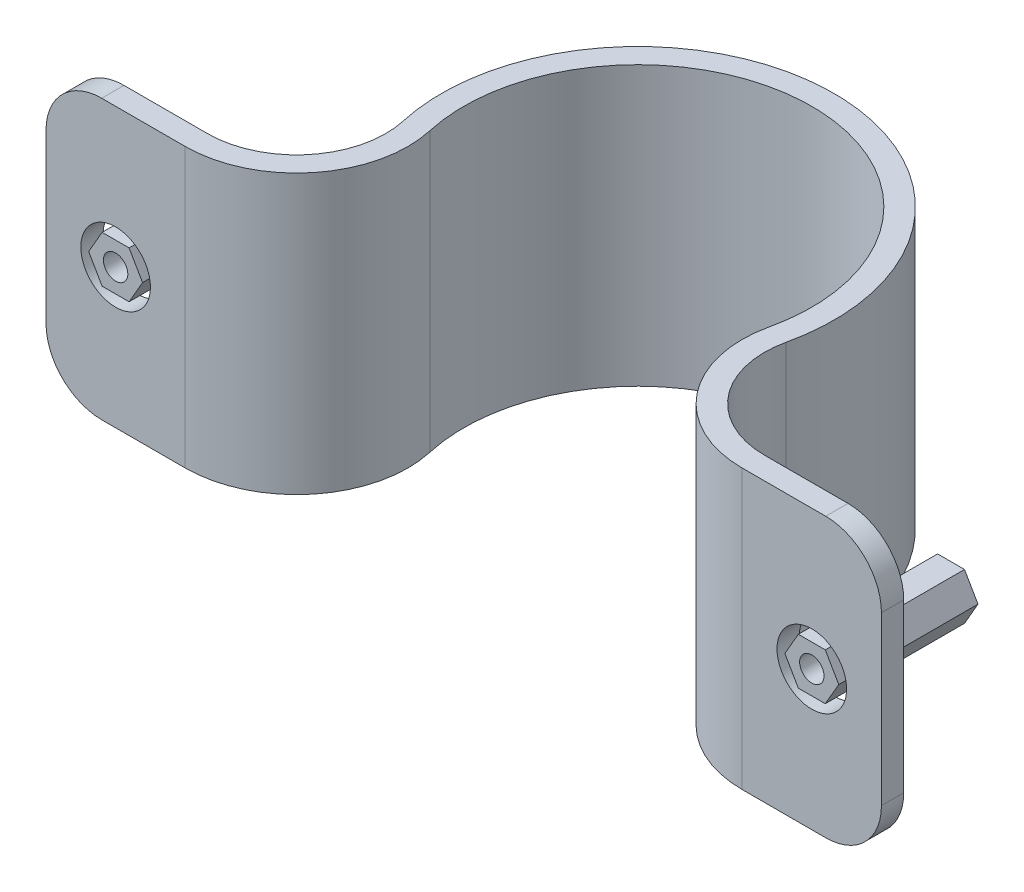
ISO-10303-21;
HEADER;
FILE_DESCRIPTION(('STEP AP214'),'2;1');
FILE_NAME('part.step','',(''),(''),'','','');
FILE_SCHEMA(('AUTOMOTIVE_DESIGN { 1 0 10303 214 1 1 1 1 }'));
ENDSEC;
DATA;
#1=APPLICATION_CONTEXT('core data for automotive mechanical design processes');
#2=APPLICATION_PROTOCOL_DEFINITION('international standard','automotive_design',2000,#1);
#3=PRODUCT_CONTEXT('',#1,'mechanical');
#4=PRODUCT('Part','Part','',(#3));
#5=PRODUCT_RELATED_PRODUCT_CATEGORY('part','',(#4));
#6=PRODUCT_DEFINITION_FORMATION('','',#4);
#7=PRODUCT_DEFINITION_CONTEXT('part definition',#1,'design');
#8=PRODUCT_DEFINITION('design','',#6,#7);
#9=PRODUCT_DEFINITION_SHAPE('','',#8);
#10=(LENGTH_UNIT() NAMED_UNIT(*) SI_UNIT(.MILLI.,.METRE.));
#11=(NAMED_UNIT(*) PLANE_ANGLE_UNIT() SI_UNIT($,.RADIAN.));
#12=(NAMED_UNIT(*) SI_UNIT($,.STERADIAN.) SOLID_ANGLE_UNIT());
#13=UNCERTAINTY_MEASURE_WITH_UNIT(LENGTH_MEASURE(1.E-05),#10,'distance_accuracy_value','');
#14=(GEOMETRIC_REPRESENTATION_CONTEXT(3) GLOBAL_UNCERTAINTY_ASSIGNED_CONTEXT((#13)) GLOBAL_UNIT_ASSIGNED_CONTEXT((#10,
#11,#12)) REPRESENTATION_CONTEXT('',''));
#15=CARTESIAN_POINT('',(0.,0.,0.));
#16=DIRECTION('',(0.,0.,1.));
#17=DIRECTION('',(1.,0.,0.));
#18=AXIS2_PLACEMENT_3D('',#15,#16,#17);
#19=CARTESIAN_POINT('',(32.9788858266036,10.5715073116213,-12.7));
#20=DIRECTION('',(0.,-1.,0.));
#21=DIRECTION('',(0.,0.,-1.));
#22=AXIS2_PLACEMENT_3D('',#19,#20,#21);
#23=PLANE('',#22);
#24=DIRECTION('',(1.,0.,0.));
#25=VECTOR('',#24,1.);
#26=CARTESIAN_POINT('',(32.9788858266036,10.5715073116213,0.));
#27=LINE('',#26,#25);
#28=CARTESIAN_POINT('',(30.5211141733964,10.5715073116213,0.));
#29=VERTEX_POINT('',#28);
#30=CARTESIAN_POINT('',(32.9788858266036,10.5715073116213,0.));
#31=VERTEX_POINT('',#30);
#32=EDGE_CURVE('E131',#29,#31,#27,.T.);
#33=ORIENTED_EDGE('',*,*,#32,.F.);
#34=DIRECTION('',(0.,0.,1.));
#35=VECTOR('',#34,1.);
#36=CARTESIAN_POINT('',(30.5211141733964,10.5715073116213,-12.7));
#37=LINE('',#36,#35);
#38=CARTESIAN_POINT('',(30.5211141733964,10.5715073116213,-12.7));
#39=VERTEX_POINT('',#38);
#40=EDGE_CURVE('E12',#39,#29,#37,.T.);
#41=ORIENTED_EDGE('',*,*,#40,.F.);
#42=DIRECTION('',(1.,0.,0.));
#43=VECTOR('',#42,1.);
#44=CARTESIAN_POINT('',(32.9788858266036,10.5715073116213,-12.7));
#45=LINE('',#44,#43);
#46=CARTESIAN_POINT('',(32.9788858266036,10.5715073116213,-12.7));
#47=VERTEX_POINT('',#46);
#48=EDGE_CURVE('E146',#39,#47,#45,.T.);
#49=ORIENTED_EDGE('',*,*,#48,.T.);
#50=DIRECTION('',(0.,0.,1.));
#51=VECTOR('',#50,1.);
#52=CARTESIAN_POINT('',(32.9788858266036,10.5715073116213,-12.7));
#53=LINE('',#52,#51);
#54=EDGE_CURVE('E49',#47,#31,#53,.T.);
#55=ORIENTED_EDGE('',*,*,#54,.T.);
#56=EDGE_LOOP('',(#33,#41,#49,#55));
#57=FACE_BOUND('',#56,.T.);
#58=ADVANCED_FACE('F46',(#57),#23,.T.);
#59=CARTESIAN_POINT('',(30.5211141733964,10.5715073116213,-12.7));
#60=DIRECTION('',(-0.866025403784439,-0.5,0.));
#61=DIRECTION('',(0.5,-0.866025403784439,0.));
#62=AXIS2_PLACEMENT_3D('',#59,#60,#61);
#63=PLANE('',#62);
#64=DIRECTION('',(0.5,-0.866025403784439,0.));
#65=VECTOR('',#64,1.);
#66=CARTESIAN_POINT('',(30.5211141733964,10.5715073116213,0.));
#67=LINE('',#66,#65);
#68=CARTESIAN_POINT('',(29.2922283467929,12.7,0.));
#69=VERTEX_POINT('',#68);
#70=EDGE_CURVE('E144',#69,#29,#67,.T.);
#71=ORIENTED_EDGE('',*,*,#70,.F.);
#72=DIRECTION('',(0.,0.,1.));
#73=VECTOR('',#72,1.);
#74=CARTESIAN_POINT('',(29.2922283467929,12.7,-12.7));
#75=LINE('',#74,#73);
#76=CARTESIAN_POINT('',(29.2922283467929,12.7,-12.7));
#77=VERTEX_POINT('',#76);
#78=EDGE_CURVE('E55',#77,#69,#75,.T.);
#79=ORIENTED_EDGE('',*,*,#78,.F.);
#80=DIRECTION('',(0.5,-0.866025403784439,0.));
#81=VECTOR('',#80,1.);
#82=CARTESIAN_POINT('',(30.5211141733964,10.5715073116213,-12.7));
#83=LINE('',#82,#81);
#84=EDGE_CURVE('E121',#77,#39,#83,.T.);
#85=ORIENTED_EDGE('',*,*,#84,.T.);
#86=ORIENTED_EDGE('',*,*,#40,.T.);
#87=EDGE_LOOP('',(#71,#79,#85,#86));
#88=FACE_BOUND('',#87,.T.);
#89=ADVANCED_FACE('F154',(#88),#63,.T.);
#90=CARTESIAN_POINT('',(29.2922283467929,12.7,-12.7));
#91=DIRECTION('',(-0.866025403784437,0.500000000000002,0.));
#92=DIRECTION('',(-0.500000000000002,-0.866025403784438,0.));
#93=AXIS2_PLACEMENT_3D('',#90,#91,#92);
#94=PLANE('',#93);
#95=DIRECTION('',(-0.500000000000002,-0.866025403784437,0.));
#96=VECTOR('',#95,1.);
#97=CARTESIAN_POINT('',(29.2922283467929,12.7,0.));
#98=LINE('',#97,#96);
#99=CARTESIAN_POINT('',(30.5211141733964,14.8284926883786,0.));
#100=VERTEX_POINT('',#99);
#101=EDGE_CURVE('E108',#100,#69,#98,.T.);
#102=ORIENTED_EDGE('',*,*,#101,.F.);
#103=DIRECTION('',(0.,0.,1.));
#104=VECTOR('',#103,1.);
#105=CARTESIAN_POINT('',(30.5211141733964,14.8284926883786,-12.7));
#106=LINE('',#105,#104);
#107=CARTESIAN_POINT('',(30.5211141733964,14.8284926883786,-12.7));
#108=VERTEX_POINT('',#107);
#109=EDGE_CURVE('E103',#108,#100,#106,.T.);
#110=ORIENTED_EDGE('',*,*,#109,.F.);
#111=DIRECTION('',(-0.500000000000002,-0.866025403784437,0.));
#112=VECTOR('',#111,1.);
#113=CARTESIAN_POINT('',(29.2922283467929,12.7,-12.7));
#114=LINE('',#113,#112);
#115=EDGE_CURVE('E106',#108,#77,#114,.T.);
#116=ORIENTED_EDGE('',*,*,#115,.T.);
#117=ORIENTED_EDGE('',*,*,#78,.T.);
#118=EDGE_LOOP('',(#102,#110,#116,#117));
#119=FACE_BOUND('',#118,.T.);
#120=ADVANCED_FACE('F105',(#119),#94,.T.);
#121=CARTESIAN_POINT('',(30.5211141733964,14.8284926883786,-12.7));
#122=DIRECTION('',(0.,1.,0.));
#123=DIRECTION('',(-1.,0.,0.));
#124=AXIS2_PLACEMENT_3D('',#121,#122,#123);
#125=PLANE('',#124);
#126=DIRECTION('',(-1.,0.,0.));
#127=VECTOR('',#126,1.);
#128=CARTESIAN_POINT('',(30.5211141733964,14.8284926883786,0.));
#129=LINE('',#128,#127);
#130=CARTESIAN_POINT('',(32.9788858266036,14.8284926883786,0.));
#131=VERTEX_POINT('',#130);
#132=EDGE_CURVE('E141',#131,#100,#129,.T.);
#133=ORIENTED_EDGE('',*,*,#132,.F.);
#134=DIRECTION('',(0.,0.,1.));
#135=VECTOR('',#134,1.);
#136=CARTESIAN_POINT('',(32.9788858266036,14.8284926883786,-12.7));
#137=LINE('',#136,#135);
#138=CARTESIAN_POINT('',(32.9788858266036,14.8284926883786,-12.7));
#139=VERTEX_POINT('',#138);
#140=EDGE_CURVE('E113',#139,#131,#137,.T.);
#141=ORIENTED_EDGE('',*,*,#140,.F.);
#142=DIRECTION('',(-1.,0.,0.));
#143=VECTOR('',#142,1.);
#144=CARTESIAN_POINT('',(30.5211141733964,14.8284926883786,-12.7));
#145=LINE('',#144,#143);
#146=EDGE_CURVE('E119',#139,#108,#145,.T.);
#147=ORIENTED_EDGE('',*,*,#146,.T.);
#148=ORIENTED_EDGE('',*,*,#109,.T.);
#149=EDGE_LOOP('',(#133,#141,#147,#148));
#150=FACE_BOUND('',#149,.T.);
#151=ADVANCED_FACE('F123',(#150),#125,.T.);
#152=CARTESIAN_POINT('',(32.9788858266036,14.8284926883786,-12.7));
#153=DIRECTION('',(0.866025403784439,0.5,0.));
#154=DIRECTION('',(-0.5,0.866025403784439,0.));
#155=AXIS2_PLACEMENT_3D('',#152,#153,#154);
#156=PLANE('',#155);
#157=DIRECTION('',(-0.5,0.866025403784439,0.));
#158=VECTOR('',#157,1.);
#159=CARTESIAN_POINT('',(32.9788858266036,14.8284926883786,0.));
#160=LINE('',#159,#158);
#161=CARTESIAN_POINT('',(34.2077716532071,12.7,0.));
#162=VERTEX_POINT('',#161);
#163=EDGE_CURVE('E138',#162,#131,#160,.T.);
#164=ORIENTED_EDGE('',*,*,#163,.F.);
#165=DIRECTION('',(0.,0.,1.));
#166=VECTOR('',#165,1.);
#167=CARTESIAN_POINT('',(34.2077716532071,12.7,-12.7));
#168=LINE('',#167,#166);
#169=CARTESIAN_POINT('',(34.2077716532071,12.7,-12.7));
#170=VERTEX_POINT('',#169);
#171=EDGE_CURVE('E149',#170,#162,#168,.T.);
#172=ORIENTED_EDGE('',*,*,#171,.F.);
#173=DIRECTION('',(-0.5,0.866025403784439,0.));
#174=VECTOR('',#173,1.);
#175=CARTESIAN_POINT('',(32.9788858266036,14.8284926883786,-12.7));
#176=LINE('',#175,#174);
#177=EDGE_CURVE('E124',#170,#139,#176,.T.);
#178=ORIENTED_EDGE('',*,*,#177,.T.);
#179=ORIENTED_EDGE('',*,*,#140,.T.);
#180=EDGE_LOOP('',(#164,#172,#178,#179));
#181=FACE_BOUND('',#180,.T.);
#182=ADVANCED_FACE('F167',(#181),#156,.T.);
#183=CARTESIAN_POINT('',(34.2077716532071,12.7,-12.7));
#184=DIRECTION('',(0.86602540378444,-0.499999999999998,0.));
#185=DIRECTION('',(0.499999999999998,0.86602540378444,0.));
#186=AXIS2_PLACEMENT_3D('',#183,#184,#185);
#187=PLANE('',#186);
#188=DIRECTION('',(0.499999999999998,0.86602540378444,0.));
#189=VECTOR('',#188,1.);
#190=CARTESIAN_POINT('',(34.2077716532071,12.7,0.));
#191=LINE('',#190,#189);
#192=EDGE_CURVE('E134',#31,#162,#191,.T.);
#193=ORIENTED_EDGE('',*,*,#192,.F.);
#194=ORIENTED_EDGE('',*,*,#54,.F.);
#195=DIRECTION('',(0.499999999999998,0.86602540378444,0.));
#196=VECTOR('',#195,1.);
#197=CARTESIAN_POINT('',(34.2077716532071,12.7,-12.7));
#198=LINE('',#197,#196);
#199=EDGE_CURVE('E126',#47,#170,#198,.T.);
#200=ORIENTED_EDGE('',*,*,#199,.T.);
#201=ORIENTED_EDGE('',*,*,#171,.T.);
#202=EDGE_LOOP('',(#193,#194,#200,#201));
#203=FACE_BOUND('',#202,.T.);
#204=ADVANCED_FACE('F151',(#203),#187,.T.);
#205=CARTESIAN_POINT('',(0.,0.,-12.7));
#206=DIRECTION('',(0.,0.,-1.));
#207=DIRECTION('',(-1.,0.,0.));
#208=AXIS2_PLACEMENT_3D('',#205,#206,#207);
#209=PLANE('',#208);
#210=CARTESIAN_POINT('',(31.75,12.7,-12.7));
#211=DIRECTION('',(0.,0.,1.));
#212=DIRECTION('',(-1.,0.,0.));
#213=AXIS2_PLACEMENT_3D('',#210,#211,#212);
#214=CIRCLE('',#213,1.11249268837864);
#215=CARTESIAN_POINT('',(30.6375073116214,12.7,-12.7));
#216=VERTEX_POINT('',#215);
#217=EDGE_CURVE('E135',#216,#216,#214,.T.);
#218=ORIENTED_EDGE('',*,*,#217,.T.);
#219=EDGE_LOOP('',(#218));
#220=FACE_BOUND('',#219,.T.);
#221=ORIENTED_EDGE('',*,*,#48,.F.);
#222=ORIENTED_EDGE('',*,*,#84,.F.);
#223=ORIENTED_EDGE('',*,*,#115,.F.);
#224=ORIENTED_EDGE('',*,*,#146,.F.);
#225=ORIENTED_EDGE('',*,*,#177,.F.);
#226=ORIENTED_EDGE('',*,*,#199,.F.);
#227=EDGE_LOOP('',(#221,#222,#223,#224,#225,#226));
#228=FACE_BOUND('',#227,.T.);
#229=ADVANCED_FACE('F117',(#220,#228),#209,.T.);
#230=CARTESIAN_POINT('',(0.,0.,0.));
#231=DIRECTION('',(0.,0.,-1.));
#232=DIRECTION('',(-1.,0.,0.));
#233=AXIS2_PLACEMENT_3D('',#230,#231,#232);
#234=PLANE('',#233);
#235=CARTESIAN_POINT('',(31.75,12.7,0.));
#236=DIRECTION('',(0.,0.,1.));
#237=DIRECTION('',(-1.,0.,0.));
#238=AXIS2_PLACEMENT_3D('',#235,#236,#237);
#239=CIRCLE('',#238,1.11249268837864);
#240=CARTESIAN_POINT('',(30.6375073116214,12.7,0.));
#241=VERTEX_POINT('',#240);
#242=EDGE_CURVE('E190',#241,#241,#239,.T.);
#243=ORIENTED_EDGE('',*,*,#242,.F.);
#244=EDGE_LOOP('',(#243));
#245=FACE_BOUND('',#244,.T.);
#246=ORIENTED_EDGE('',*,*,#32,.T.);
#247=ORIENTED_EDGE('',*,*,#192,.T.);
#248=ORIENTED_EDGE('',*,*,#163,.T.);
#249=ORIENTED_EDGE('',*,*,#132,.T.);
#250=ORIENTED_EDGE('',*,*,#101,.T.);
#251=ORIENTED_EDGE('',*,*,#70,.T.);
#252=EDGE_LOOP('',(#246,#247,#248,#249,#250,#251));
#253=FACE_BOUND('',#252,.T.);
#254=ADVANCED_FACE('F153',(#245,#253),#234,.F.);
#255=CARTESIAN_POINT('',(31.75,12.7,-12.7));
#256=DIRECTION('',(0.,0.,1.));
#257=DIRECTION('',(1.,0.,0.));
#258=AXIS2_PLACEMENT_3D('',#255,#256,#257);
#259=CYLINDRICAL_SURFACE('',#258,1.11249268837864);
#260=ORIENTED_EDGE('',*,*,#217,.F.);
#261=EDGE_LOOP('',(#260));
#262=FACE_BOUND('',#261,.T.);
#263=ORIENTED_EDGE('',*,*,#242,.T.);
#264=EDGE_LOOP('',(#263));
#265=FACE_BOUND('',#264,.T.);
#266=ADVANCED_FACE('F178',(#262,#265),#259,.F.);
#267=CLOSED_SHELL('',(#58,#89,#120,#151,#182,#204,#229,#254,#266));
#268=MANIFOLD_SOLID_BREP('B2',#267);
#269=CARTESIAN_POINT('',(-30.5211141733964,10.5715073116214,-12.7));
#270=DIRECTION('',(0.866025403784439,-0.5,0.));
#271=DIRECTION('',(0.5,0.866025403784439,0.));
#272=AXIS2_PLACEMENT_3D('',#269,#270,#271);
#273=PLANE('',#272);
#274=DIRECTION('',(0.5,0.866025403784439,0.));
#275=VECTOR('',#274,1.);
#276=CARTESIAN_POINT('',(-30.5211141733964,10.5715073116214,0.));
#277=LINE('',#276,#275);
#278=CARTESIAN_POINT('',(-30.5211141733964,10.5715073116214,0.));
#279=VERTEX_POINT('',#278);
#280=CARTESIAN_POINT('',(-29.2922283467929,12.7,0.));
#281=VERTEX_POINT('',#280);
#282=EDGE_CURVE('E337',#279,#281,#277,.T.);
#283=ORIENTED_EDGE('',*,*,#282,.F.);
#284=DIRECTION('',(0.,0.,1.));
#285=VECTOR('',#284,1.);
#286=CARTESIAN_POINT('',(-30.5211141733964,10.5715073116214,-12.7));
#287=LINE('',#286,#285);
#288=CARTESIAN_POINT('',(-30.5211141733964,10.5715073116214,-12.7));
#289=VERTEX_POINT('',#288);
#290=EDGE_CURVE('E44',#289,#279,#287,.T.);
#291=ORIENTED_EDGE('',*,*,#290,.F.);
#292=DIRECTION('',(0.5,0.866025403784439,0.));
#293=VECTOR('',#292,1.);
#294=CARTESIAN_POINT('',(-30.5211141733964,10.5715073116214,-12.7));
#295=LINE('',#294,#293);
#296=CARTESIAN_POINT('',(-29.2922283467929,12.7,-12.7));
#297=VERTEX_POINT('',#296);
#298=EDGE_CURVE('E352',#289,#297,#295,.T.);
#299=ORIENTED_EDGE('',*,*,#298,.T.);
#300=DIRECTION('',(0.,0.,1.));
#301=VECTOR('',#300,1.);
#302=CARTESIAN_POINT('',(-29.2922283467929,12.7,-12.7));
#303=LINE('',#302,#301);
#304=EDGE_CURVE('E255',#297,#281,#303,.T.);
#305=ORIENTED_EDGE('',*,*,#304,.T.);
#306=EDGE_LOOP('',(#283,#291,#299,#305));
#307=FACE_BOUND('',#306,.T.);
#308=ADVANCED_FACE('F252',(#307),#273,.T.);
#309=CARTESIAN_POINT('',(-32.9788858266036,10.5715073116214,-12.7));
#310=DIRECTION('',(0.,-1.,0.));
#311=DIRECTION('',(0.,0.,-1.));
#312=AXIS2_PLACEMENT_3D('',#309,#310,#311);
#313=PLANE('',#312);
#314=DIRECTION('',(1.,0.,0.));
#315=VECTOR('',#314,1.);
#316=CARTESIAN_POINT('',(-32.9788858266036,10.5715073116214,0.));
#317=LINE('',#316,#315);
#318=CARTESIAN_POINT('',(-32.9788858266036,10.5715073116214,0.));
#319=VERTEX_POINT('',#318);
#320=EDGE_CURVE('E350',#319,#279,#317,.T.);
#321=ORIENTED_EDGE('',*,*,#320,.F.);
#322=DIRECTION('',(0.,0.,1.));
#323=VECTOR('',#322,1.);
#324=CARTESIAN_POINT('',(-32.9788858266036,10.5715073116214,-12.7));
#325=LINE('',#324,#323);
#326=CARTESIAN_POINT('',(-32.9788858266036,10.5715073116214,-12.7));
#327=VERTEX_POINT('',#326);
#328=EDGE_CURVE('E261',#327,#319,#325,.T.);
#329=ORIENTED_EDGE('',*,*,#328,.F.);
#330=DIRECTION('',(1.,0.,0.));
#331=VECTOR('',#330,1.);
#332=CARTESIAN_POINT('',(-32.9788858266036,10.5715073116214,-12.7));
#333=LINE('',#332,#331);
#334=EDGE_CURVE('E327',#327,#289,#333,.T.);
#335=ORIENTED_EDGE('',*,*,#334,.T.);
#336=ORIENTED_EDGE('',*,*,#290,.T.);
#337=EDGE_LOOP('',(#321,#329,#335,#336));
#338=FACE_BOUND('',#337,.T.);
#339=ADVANCED_FACE('F360',(#338),#313,.T.);
#340=CARTESIAN_POINT('',(-34.2077716532071,12.7,-12.7));
#341=DIRECTION('',(-0.86602540378444,-0.499999999999998,0.));
#342=DIRECTION('',(0.499999999999998,-0.86602540378444,0.));
#343=AXIS2_PLACEMENT_3D('',#340,#341,#342);
#344=PLANE('',#343);
#345=DIRECTION('',(0.499999999999998,-0.86602540378444,0.));
#346=VECTOR('',#345,1.);
#347=CARTESIAN_POINT('',(-34.2077716532071,12.7,0.));
#348=LINE('',#347,#346);
#349=CARTESIAN_POINT('',(-34.2077716532071,12.7,0.));
#350=VERTEX_POINT('',#349);
#351=EDGE_CURVE('E314',#350,#319,#348,.T.);
#352=ORIENTED_EDGE('',*,*,#351,.F.);
#353=DIRECTION('',(0.,0.,1.));
#354=VECTOR('',#353,1.);
#355=CARTESIAN_POINT('',(-34.2077716532071,12.7,-12.7));
#356=LINE('',#355,#354);
#357=CARTESIAN_POINT('',(-34.2077716532071,12.7,-12.7));
#358=VERTEX_POINT('',#357);
#359=EDGE_CURVE('E309',#358,#350,#356,.T.);
#360=ORIENTED_EDGE('',*,*,#359,.F.);
#361=DIRECTION('',(0.499999999999998,-0.86602540378444,0.));
#362=VECTOR('',#361,1.);
#363=CARTESIAN_POINT('',(-34.2077716532071,12.7,-12.7));
#364=LINE('',#363,#362);
#365=EDGE_CURVE('E312',#358,#327,#364,.T.);
#366=ORIENTED_EDGE('',*,*,#365,.T.);
#367=ORIENTED_EDGE('',*,*,#328,.T.);
#368=EDGE_LOOP('',(#352,#360,#366,#367));
#369=FACE_BOUND('',#368,.T.);
#370=ADVANCED_FACE('F311',(#369),#344,.T.);
#371=CARTESIAN_POINT('',(-32.9788858266036,14.8284926883786,-12.7));
#372=DIRECTION('',(-0.866025403784439,0.5,0.));
#373=DIRECTION('',(-0.5,-0.866025403784439,0.));
#374=AXIS2_PLACEMENT_3D('',#371,#372,#373);
#375=PLANE('',#374);
#376=DIRECTION('',(-0.5,-0.866025403784439,0.));
#377=VECTOR('',#376,1.);
#378=CARTESIAN_POINT('',(-32.9788858266036,14.8284926883786,0.));
#379=LINE('',#378,#377);
#380=CARTESIAN_POINT('',(-32.9788858266036,14.8284926883786,0.));
#381=VERTEX_POINT('',#380);
#382=EDGE_CURVE('E347',#381,#350,#379,.T.);
#383=ORIENTED_EDGE('',*,*,#382,.F.);
#384=DIRECTION('',(0.,0.,1.));
#385=VECTOR('',#384,1.);
#386=CARTESIAN_POINT('',(-32.9788858266036,14.8284926883786,-12.7));
#387=LINE('',#386,#385);
#388=CARTESIAN_POINT('',(-32.9788858266036,14.8284926883786,-12.7));
#389=VERTEX_POINT('',#388);
#390=EDGE_CURVE('E319',#389,#381,#387,.T.);
#391=ORIENTED_EDGE('',*,*,#390,.F.);
#392=DIRECTION('',(-0.5,-0.866025403784439,0.));
#393=VECTOR('',#392,1.);
#394=CARTESIAN_POINT('',(-32.9788858266036,14.8284926883786,-12.7));
#395=LINE('',#394,#393);
#396=EDGE_CURVE('E325',#389,#358,#395,.T.);
#397=ORIENTED_EDGE('',*,*,#396,.T.);
#398=ORIENTED_EDGE('',*,*,#359,.T.);
#399=EDGE_LOOP('',(#383,#391,#397,#398));
#400=FACE_BOUND('',#399,.T.);
#401=ADVANCED_FACE('F329',(#400),#375,.T.);
#402=CARTESIAN_POINT('',(-30.5211141733964,14.8284926883787,-12.7));
#403=DIRECTION('',(0.,1.,0.));
#404=DIRECTION('',(-1.,0.,0.));
#405=AXIS2_PLACEMENT_3D('',#402,#403,#404);
#406=PLANE('',#405);
#407=DIRECTION('',(-1.,0.,0.));
#408=VECTOR('',#407,1.);
#409=CARTESIAN_POINT('',(-30.5211141733964,14.8284926883787,0.));
#410=LINE('',#409,#408);
#411=CARTESIAN_POINT('',(-30.5211141733964,14.8284926883787,0.));
#412=VERTEX_POINT('',#411);
#413=EDGE_CURVE('E344',#412,#381,#410,.T.);
#414=ORIENTED_EDGE('',*,*,#413,.F.);
#415=DIRECTION('',(0.,0.,1.));
#416=VECTOR('',#415,1.);
#417=CARTESIAN_POINT('',(-30.5211141733964,14.8284926883787,-12.7));
#418=LINE('',#417,#416);
#419=CARTESIAN_POINT('',(-30.5211141733964,14.8284926883787,-12.7));
#420=VERTEX_POINT('',#419);
#421=EDGE_CURVE('E355',#420,#412,#418,.T.);
#422=ORIENTED_EDGE('',*,*,#421,.F.);
#423=DIRECTION('',(-1.,0.,0.));
#424=VECTOR('',#423,1.);
#425=CARTESIAN_POINT('',(-30.5211141733964,14.8284926883787,-12.7));
#426=LINE('',#425,#424);
#427=EDGE_CURVE('E330',#420,#389,#426,.T.);
#428=ORIENTED_EDGE('',*,*,#427,.T.);
#429=ORIENTED_EDGE('',*,*,#390,.T.);
#430=EDGE_LOOP('',(#414,#422,#428,#429));
#431=FACE_BOUND('',#430,.T.);
#432=ADVANCED_FACE('F373',(#431),#406,.T.);
#433=CARTESIAN_POINT('',(-29.2922283467929,12.7,-12.7));
#434=DIRECTION('',(0.866025403784437,0.500000000000002,0.));
#435=DIRECTION('',(-0.500000000000002,0.866025403784438,0.));
#436=AXIS2_PLACEMENT_3D('',#433,#434,#435);
#437=PLANE('',#436);
#438=DIRECTION('',(-0.500000000000002,0.866025403784437,0.));
#439=VECTOR('',#438,1.);
#440=CARTESIAN_POINT('',(-29.2922283467929,12.7,0.));
#441=LINE('',#440,#439);
#442=EDGE_CURVE('E340',#281,#412,#441,.T.);
#443=ORIENTED_EDGE('',*,*,#442,.F.);
#444=ORIENTED_EDGE('',*,*,#304,.F.);
#445=DIRECTION('',(-0.500000000000002,0.866025403784437,0.));
#446=VECTOR('',#445,1.);
#447=CARTESIAN_POINT('',(-29.2922283467929,12.7,-12.7));
#448=LINE('',#447,#446);
#449=EDGE_CURVE('E332',#297,#420,#448,.T.);
#450=ORIENTED_EDGE('',*,*,#449,.T.);
#451=ORIENTED_EDGE('',*,*,#421,.T.);
#452=EDGE_LOOP('',(#443,#444,#450,#451));
#453=FACE_BOUND('',#452,.T.);
#454=ADVANCED_FACE('F357',(#453),#437,.T.);
#455=CARTESIAN_POINT('',(0.,0.,-12.7));
#456=DIRECTION('',(0.,0.,1.));
#457=DIRECTION('',(1.,0.,0.));
#458=AXIS2_PLACEMENT_3D('',#455,#456,#457);
#459=PLANE('',#458);
#460=CARTESIAN_POINT('',(-31.75,12.7,-12.7));
#461=DIRECTION('',(0.,0.,1.));
#462=DIRECTION('',(1.,0.,0.));
#463=AXIS2_PLACEMENT_3D('',#460,#461,#462);
#464=CIRCLE('',#463,1.11249268837864);
#465=CARTESIAN_POINT('',(-30.6375073116214,12.7,-12.7));
#466=VERTEX_POINT('',#465);
#467=EDGE_CURVE('E341',#466,#466,#464,.T.);
#468=ORIENTED_EDGE('',*,*,#467,.T.);
#469=EDGE_LOOP('',(#468));
#470=FACE_BOUND('',#469,.T.);
#471=ORIENTED_EDGE('',*,*,#298,.F.);
#472=ORIENTED_EDGE('',*,*,#334,.F.);
#473=ORIENTED_EDGE('',*,*,#365,.F.);
#474=ORIENTED_EDGE('',*,*,#396,.F.);
#475=ORIENTED_EDGE('',*,*,#427,.F.);
#476=ORIENTED_EDGE('',*,*,#449,.F.);
#477=EDGE_LOOP('',(#471,#472,#473,#474,#475,#476));
#478=FACE_BOUND('',#477,.T.);
#479=ADVANCED_FACE('F323',(#470,#478),#459,.F.);
#480=CARTESIAN_POINT('',(0.,0.,0.));
#481=DIRECTION('',(0.,0.,1.));
#482=DIRECTION('',(1.,0.,0.));
#483=AXIS2_PLACEMENT_3D('',#480,#481,#482);
#484=PLANE('',#483);
#485=CARTESIAN_POINT('',(-31.75,12.7,0.));
#486=DIRECTION('',(0.,0.,1.));
#487=DIRECTION('',(1.,0.,0.));
#488=AXIS2_PLACEMENT_3D('',#485,#486,#487);
#489=CIRCLE('',#488,1.11249268837864);
#490=CARTESIAN_POINT('',(-30.6375073116214,12.7,0.));
#491=VERTEX_POINT('',#490);
#492=EDGE_CURVE('E396',#491,#491,#489,.T.);
#493=ORIENTED_EDGE('',*,*,#492,.F.);
#494=EDGE_LOOP('',(#493));
#495=FACE_BOUND('',#494,.T.);
#496=ORIENTED_EDGE('',*,*,#282,.T.);
#497=ORIENTED_EDGE('',*,*,#442,.T.);
#498=ORIENTED_EDGE('',*,*,#413,.T.);
#499=ORIENTED_EDGE('',*,*,#382,.T.);
#500=ORIENTED_EDGE('',*,*,#351,.T.);
#501=ORIENTED_EDGE('',*,*,#320,.T.);
#502=EDGE_LOOP('',(#496,#497,#498,#499,#500,#501));
#503=FACE_BOUND('',#502,.T.);
#504=ADVANCED_FACE('F359',(#495,#503),#484,.T.);
#505=CARTESIAN_POINT('',(-31.75,12.7,-12.7));
#506=DIRECTION('',(0.,0.,1.));
#507=DIRECTION('',(1.,0.,0.));
#508=AXIS2_PLACEMENT_3D('',#505,#506,#507);
#509=CYLINDRICAL_SURFACE('',#508,1.11249268837864);
#510=ORIENTED_EDGE('',*,*,#467,.F.);
#511=EDGE_LOOP('',(#510));
#512=FACE_BOUND('',#511,.T.);
#513=ORIENTED_EDGE('',*,*,#492,.T.);
#514=EDGE_LOOP('',(#513));
#515=FACE_BOUND('',#514,.T.);
#516=ADVANCED_FACE('F384',(#512,#515),#509,.F.);
#517=CLOSED_SHELL('',(#308,#339,#370,#401,#432,#454,#479,#504,#516));
#518=MANIFOLD_SOLID_BREP('B6',#517);
#519=CARTESIAN_POINT('',(25.4,25.4,-10.16));
#520=DIRECTION('',(0.,-1.,0.));
#521=DIRECTION('',(0.,0.,-1.));
#522=AXIS2_PLACEMENT_3D('',#519,#520,#521);
#523=CYLINDRICAL_SURFACE('',#522,8.128);
#524=CARTESIAN_POINT('',(25.4,0.,-10.16));
#525=DIRECTION('',(0.,-1.,0.));
#526=DIRECTION('',(0.,0.,-1.));
#527=AXIS2_PLACEMENT_3D('',#524,#525,#526);
#528=CIRCLE('',#527,8.128);
#529=CARTESIAN_POINT('',(25.4,0.,-2.032));
#530=VERTEX_POINT('',#529);
#531=CARTESIAN_POINT('',(17.470243902439,0.,-11.9441951219512));
#532=VERTEX_POINT('',#531);
#533=EDGE_CURVE('E580',#530,#532,#528,.T.);
#534=ORIENTED_EDGE('',*,*,#533,.T.);
#535=DIRECTION('',(0.,-1.,0.));
#536=VECTOR('',#535,1.);
#537=CARTESIAN_POINT('',(17.470243902439,25.4,-11.9441951219512));
#538=LINE('',#537,#536);
#539=CARTESIAN_POINT('',(17.470243902439,25.4,-11.9441951219512));
#540=VERTEX_POINT('',#539);
#541=EDGE_CURVE('E656',#540,#532,#538,.T.);
#542=ORIENTED_EDGE('',*,*,#541,.F.);
#543=CARTESIAN_POINT('',(25.4,25.4,-10.16));
#544=DIRECTION('',(0.,-1.,0.));
#545=DIRECTION('',(0.,0.,-1.));
#546=AXIS2_PLACEMENT_3D('',#543,#544,#545);
#547=CIRCLE('',#546,8.128);
#548=CARTESIAN_POINT('',(25.4,25.4,-2.032));
#549=VERTEX_POINT('',#548);
#550=EDGE_CURVE('E616',#549,#540,#547,.T.);
#551=ORIENTED_EDGE('',*,*,#550,.F.);
#552=DIRECTION('',(0.,-1.,0.));
#553=VECTOR('',#552,1.);
#554=CARTESIAN_POINT('',(25.4,25.4,-2.032));
#555=LINE('',#554,#553);
#556=EDGE_CURVE('E629',#549,#530,#555,.T.);
#557=ORIENTED_EDGE('',*,*,#556,.T.);
#558=EDGE_LOOP('',(#534,#542,#551,#557));
#559=FACE_BOUND('',#558,.T.);
#560=ADVANCED_FACE('F448',(#559),#523,.F.);
#561=CARTESIAN_POINT('',(0.,25.4,-15.875));
#562=DIRECTION('',(0.,-1.,0.));
#563=DIRECTION('',(0.,0.,-1.));
#564=AXIS2_PLACEMENT_3D('',#561,#562,#563);
#565=CYLINDRICAL_SURFACE('',#564,17.907);
#566=CARTESIAN_POINT('',(0.,0.,-15.875));
#567=DIRECTION('',(0.,1.,0.));
#568=DIRECTION('',(0.,0.,-1.));
#569=AXIS2_PLACEMENT_3D('',#566,#567,#568);
#570=CIRCLE('',#569,17.907);
#571=CARTESIAN_POINT('',(-17.470243902439,0.,-11.9441951219512));
#572=VERTEX_POINT('',#571);
#573=EDGE_CURVE('E632',#532,#572,#570,.T.);
#574=ORIENTED_EDGE('',*,*,#573,.T.);
#575=DIRECTION('',(0.,-1.,0.));
#576=VECTOR('',#575,1.);
#577=CARTESIAN_POINT('',(-17.470243902439,25.4,-11.9441951219512));
#578=LINE('',#577,#576);
#579=CARTESIAN_POINT('',(-17.470243902439,25.4,-11.9441951219512));
#580=VERTEX_POINT('',#579);
#581=EDGE_CURVE('E600',#580,#572,#578,.T.);
#582=ORIENTED_EDGE('',*,*,#581,.F.);
#583=CARTESIAN_POINT('',(0.,25.4,-15.875));
#584=DIRECTION('',(0.,1.,0.));
#585=DIRECTION('',(0.,0.,-1.));
#586=AXIS2_PLACEMENT_3D('',#583,#584,#585);
#587=CIRCLE('',#586,17.907);
#588=EDGE_CURVE('E585',#540,#580,#587,.T.);
#589=ORIENTED_EDGE('',*,*,#588,.F.);
#590=ORIENTED_EDGE('',*,*,#541,.T.);
#591=EDGE_LOOP('',(#574,#582,#589,#590));
#592=FACE_BOUND('',#591,.T.);
#593=ADVANCED_FACE('F703',(#592),#565,.T.);
#594=CARTESIAN_POINT('',(0.,25.4,-15.875));
#595=DIRECTION('',(0.,-1.,0.));
#596=DIRECTION('',(0.,0.,-1.));
#597=AXIS2_PLACEMENT_3D('',#594,#595,#596);
#598=CYLINDRICAL_SURFACE('',#597,15.875);
#599=CARTESIAN_POINT('',(0.,0.,-15.875));
#600=DIRECTION('',(0.,-1.,0.));
#601=DIRECTION('',(0.,0.,1.));
#602=AXIS2_PLACEMENT_3D('',#599,#600,#601);
#603=CIRCLE('',#602,15.875);
#604=CARTESIAN_POINT('',(-15.4878048780488,0.,-12.390243902439));
#605=VERTEX_POINT('',#604);
#606=CARTESIAN_POINT('',(15.4878048780488,0.,-12.390243902439));
#607=VERTEX_POINT('',#606);
#608=EDGE_CURVE('E634',#605,#607,#603,.T.);
#609=ORIENTED_EDGE('',*,*,#608,.T.);
#610=DIRECTION('',(0.,-1.,0.));
#611=VECTOR('',#610,1.);
#612=CARTESIAN_POINT('',(15.4878048780488,25.4,-12.390243902439));
#613=LINE('',#612,#611);
#614=CARTESIAN_POINT('',(15.4878048780488,25.4,-12.390243902439));
#615=VERTEX_POINT('',#614);
#616=EDGE_CURVE('E653',#615,#607,#613,.T.);
#617=ORIENTED_EDGE('',*,*,#616,.F.);
#618=CARTESIAN_POINT('',(0.,25.4,-15.875));
#619=DIRECTION('',(0.,-1.,0.));
#620=DIRECTION('',(0.,0.,1.));
#621=AXIS2_PLACEMENT_3D('',#618,#619,#620);
#622=CIRCLE('',#621,15.875);
#623=CARTESIAN_POINT('',(-15.4878048780488,25.4,-12.390243902439));
#624=VERTEX_POINT('',#623);
#625=EDGE_CURVE('E620',#624,#615,#622,.T.);
#626=ORIENTED_EDGE('',*,*,#625,.F.);
#627=DIRECTION('',(0.,-1.,0.));
#628=VECTOR('',#627,1.);
#629=CARTESIAN_POINT('',(-15.4878048780488,25.4,-12.390243902439));
#630=LINE('',#629,#628);
#631=EDGE_CURVE('E608',#624,#605,#630,.T.);
#632=ORIENTED_EDGE('',*,*,#631,.T.);
#633=EDGE_LOOP('',(#609,#617,#626,#632));
#634=FACE_BOUND('',#633,.T.);
#635=ADVANCED_FACE('F726',(#634),#598,.F.);
#636=CARTESIAN_POINT('',(25.4,25.4,-10.16));
#637=DIRECTION('',(0.,-1.,0.));
#638=DIRECTION('',(0.,0.,-1.));
#639=AXIS2_PLACEMENT_3D('',#636,#637,#638);
#640=CYLINDRICAL_SURFACE('',#639,10.16);
#641=CARTESIAN_POINT('',(25.4,0.,-10.16));
#642=DIRECTION('',(0.,1.,0.));
#643=DIRECTION('',(0.,0.,-1.));
#644=AXIS2_PLACEMENT_3D('',#641,#642,#643);
#645=CIRCLE('',#644,10.16);
#646=CARTESIAN_POINT('',(25.4,0.,0.));
#647=VERTEX_POINT('',#646);
#648=EDGE_CURVE('E636',#607,#647,#645,.T.);
#649=ORIENTED_EDGE('',*,*,#648,.T.);
#650=DIRECTION('',(0.,-1.,0.));
#651=VECTOR('',#650,1.);
#652=CARTESIAN_POINT('',(25.4,25.4,0.));
#653=LINE('',#652,#651);
#654=CARTESIAN_POINT('',(25.4,25.4,0.));
#655=VERTEX_POINT('',#654);
#656=EDGE_CURVE('E650',#655,#647,#653,.T.);
#657=ORIENTED_EDGE('',*,*,#656,.F.);
#658=CARTESIAN_POINT('',(25.4,25.4,-10.16));
#659=DIRECTION('',(0.,1.,0.));
#660=DIRECTION('',(0.,0.,-1.));
#661=AXIS2_PLACEMENT_3D('',#658,#659,#660);
#662=CIRCLE('',#661,10.16);
#663=EDGE_CURVE('E622',#615,#655,#662,.T.);
#664=ORIENTED_EDGE('',*,*,#663,.F.);
#665=ORIENTED_EDGE('',*,*,#616,.T.);
#666=EDGE_LOOP('',(#649,#657,#664,#665));
#667=FACE_BOUND('',#666,.T.);
#668=ADVANCED_FACE('F728',(#667),#640,.T.);
#669=CARTESIAN_POINT('',(25.4,25.4,0.));
#670=DIRECTION('',(0.,0.,-1.));
#671=DIRECTION('',(-1.,0.,0.));
#672=AXIS2_PLACEMENT_3D('',#669,#670,#671);
#673=PLANE('',#672);
#674=CARTESIAN_POINT('',(31.75,12.7,0.));
#675=DIRECTION('',(0.,0.,-1.));
#676=DIRECTION('',(-1.,0.,0.));
#677=AXIS2_PLACEMENT_3D('',#674,#675,#676);
#678=CIRCLE('',#677,3.175);
#679=CARTESIAN_POINT('',(28.575,12.7,0.));
#680=VERTEX_POINT('',#679);
#681=EDGE_CURVE('E603',#680,#680,#678,.T.);
#682=ORIENTED_EDGE('',*,*,#681,.T.);
#683=EDGE_LOOP('',(#682));
#684=FACE_BOUND('',#683,.T.);
#685=DIRECTION('',(1.,0.,0.));
#686=VECTOR('',#685,1.);
#687=CARTESIAN_POINT('',(25.4,0.,0.));
#688=LINE('',#687,#686);
#689=CARTESIAN_POINT('',(33.02,0.,0.));
#690=VERTEX_POINT('',#689);
#691=EDGE_CURVE('E638',#647,#690,#688,.T.);
#692=ORIENTED_EDGE('',*,*,#691,.T.);
#693=CARTESIAN_POINT('',(33.02,5.08,0.));
#694=DIRECTION('',(0.,0.,-1.));
#695=DIRECTION('',(-1.,0.,0.));
#696=AXIS2_PLACEMENT_3D('',#693,#694,#695);
#697=CIRCLE('',#696,5.08);
#698=CARTESIAN_POINT('',(38.1,5.08,0.));
#699=VERTEX_POINT('',#698);
#700=EDGE_CURVE('E675',#690,#699,#697,.F.);
#701=ORIENTED_EDGE('',*,*,#700,.T.);
#702=DIRECTION('',(0.,-1.,0.));
#703=VECTOR('',#702,1.);
#704=CARTESIAN_POINT('',(38.1,25.4,0.));
#705=LINE('',#704,#703);
#706=CARTESIAN_POINT('',(38.1,20.32,0.));
#707=VERTEX_POINT('',#706);
#708=EDGE_CURVE('E647',#707,#699,#705,.T.);
#709=ORIENTED_EDGE('',*,*,#708,.F.);
#710=CARTESIAN_POINT('',(33.02,20.32,0.));
#711=DIRECTION('',(0.,0.,-1.));
#712=DIRECTION('',(-1.,0.,0.));
#713=AXIS2_PLACEMENT_3D('',#710,#711,#712);
#714=CIRCLE('',#713,5.08);
#715=CARTESIAN_POINT('',(33.02,25.4,0.));
#716=VERTEX_POINT('',#715);
#717=EDGE_CURVE('E673',#707,#716,#714,.F.);
#718=ORIENTED_EDGE('',*,*,#717,.T.);
#719=DIRECTION('',(1.,0.,0.));
#720=VECTOR('',#719,1.);
#721=CARTESIAN_POINT('',(25.4,25.4,0.));
#722=LINE('',#721,#720);
#723=EDGE_CURVE('E624',#655,#716,#722,.T.);
#724=ORIENTED_EDGE('',*,*,#723,.F.);
#725=ORIENTED_EDGE('',*,*,#656,.T.);
#726=EDGE_LOOP('',(#692,#701,#709,#718,#724,#725));
#727=FACE_BOUND('',#726,.T.);
#728=ADVANCED_FACE('F731',(#684,#727),#673,.F.);
#729=CARTESIAN_POINT('',(38.1,25.4,-2.032));
#730=DIRECTION('',(-1.,0.,0.));
#731=DIRECTION('',(0.,0.,1.));
#732=AXIS2_PLACEMENT_3D('',#729,#730,#731);
#733=PLANE('',#732);
#734=ORIENTED_EDGE('',*,*,#708,.T.);
#735=DIRECTION('',(0.,0.,-1.));
#736=VECTOR('',#735,1.);
#737=CARTESIAN_POINT('',(38.1,5.08,-2.032));
#738=LINE('',#737,#736);
#739=CARTESIAN_POINT('',(38.1,5.08,-2.032));
#740=VERTEX_POINT('',#739);
#741=EDGE_CURVE('E661',#699,#740,#738,.T.);
#742=ORIENTED_EDGE('',*,*,#741,.T.);
#743=DIRECTION('',(0.,-1.,0.));
#744=VECTOR('',#743,1.);
#745=CARTESIAN_POINT('',(38.1,25.4,-2.032));
#746=LINE('',#745,#744);
#747=CARTESIAN_POINT('',(38.1,20.32,-2.032));
#748=VERTEX_POINT('',#747);
#749=EDGE_CURVE('E644',#748,#740,#746,.T.);
#750=ORIENTED_EDGE('',*,*,#749,.F.);
#751=DIRECTION('',(0.,0.,-1.));
#752=VECTOR('',#751,1.);
#753=CARTESIAN_POINT('',(38.1,20.32,-2.032));
#754=LINE('',#753,#752);
#755=EDGE_CURVE('E659',#748,#707,#754,.F.);
#756=ORIENTED_EDGE('',*,*,#755,.T.);
#757=EDGE_LOOP('',(#734,#742,#750,#756));
#758=FACE_BOUND('',#757,.T.);
#759=ADVANCED_FACE('F735',(#758),#733,.F.);
#760=CARTESIAN_POINT('',(25.4,25.4,-2.032));
#761=DIRECTION('',(0.,0.,1.));
#762=DIRECTION('',(1.,0.,0.));
#763=AXIS2_PLACEMENT_3D('',#760,#761,#762);
#764=PLANE('',#763);
#765=CARTESIAN_POINT('',(31.75,12.7,-2.032));
#766=DIRECTION('',(0.,0.,-1.));
#767=DIRECTION('',(-1.,0.,0.));
#768=AXIS2_PLACEMENT_3D('',#765,#766,#767);
#769=CIRCLE('',#768,3.175);
#770=CARTESIAN_POINT('',(28.575,12.7,-2.032));
#771=VERTEX_POINT('',#770);
#772=EDGE_CURVE('E593',#771,#771,#769,.T.);
#773=ORIENTED_EDGE('',*,*,#772,.F.);
#774=EDGE_LOOP('',(#773));
#775=FACE_BOUND('',#774,.T.);
#776=ORIENTED_EDGE('',*,*,#749,.T.);
#777=CARTESIAN_POINT('',(33.02,5.08,-2.032));
#778=DIRECTION('',(0.,0.,1.));
#779=DIRECTION('',(1.,0.,0.));
#780=AXIS2_PLACEMENT_3D('',#777,#778,#779);
#781=CIRCLE('',#780,5.08);
#782=CARTESIAN_POINT('',(33.02,0.,-2.032));
#783=VERTEX_POINT('',#782);
#784=EDGE_CURVE('E666',#740,#783,#781,.F.);
#785=ORIENTED_EDGE('',*,*,#784,.T.);
#786=DIRECTION('',(-1.,0.,0.));
#787=VECTOR('',#786,1.);
#788=CARTESIAN_POINT('',(25.4,0.,-2.032));
#789=LINE('',#788,#787);
#790=EDGE_CURVE('E618',#783,#530,#789,.T.);
#791=ORIENTED_EDGE('',*,*,#790,.T.);
#792=ORIENTED_EDGE('',*,*,#556,.F.);
#793=DIRECTION('',(-1.,0.,0.));
#794=VECTOR('',#793,1.);
#795=CARTESIAN_POINT('',(25.4,25.4,-2.032));
#796=LINE('',#795,#794);
#797=CARTESIAN_POINT('',(33.02,25.4,-2.032));
#798=VERTEX_POINT('',#797);
#799=EDGE_CURVE('E627',#798,#549,#796,.T.);
#800=ORIENTED_EDGE('',*,*,#799,.F.);
#801=CARTESIAN_POINT('',(33.02,20.32,-2.032));
#802=DIRECTION('',(0.,0.,1.));
#803=DIRECTION('',(1.,0.,0.));
#804=AXIS2_PLACEMENT_3D('',#801,#802,#803);
#805=CIRCLE('',#804,5.08);
#806=EDGE_CURVE('E664',#798,#748,#805,.F.);
#807=ORIENTED_EDGE('',*,*,#806,.T.);
#808=EDGE_LOOP('',(#776,#785,#791,#792,#800,#807));
#809=FACE_BOUND('',#808,.T.);
#810=ADVANCED_FACE('F695',(#775,#809),#764,.F.);
#811=CARTESIAN_POINT('',(25.4,25.4,-10.16));
#812=DIRECTION('',(0.,-1.,0.));
#813=DIRECTION('',(0.,0.,-1.));
#814=AXIS2_PLACEMENT_3D('',#811,#812,#813);
#815=PLANE('',#814);
#816=DIRECTION('',(1.,0.,0.));
#817=VECTOR('',#816,1.);
#818=CARTESIAN_POINT('',(-25.4,25.4,-2.032));
#819=LINE('',#818,#817);
#820=CARTESIAN_POINT('',(-33.02,25.4,-2.032));
#821=VERTEX_POINT('',#820);
#822=CARTESIAN_POINT('',(-25.4,25.4,-2.032));
#823=VERTEX_POINT('',#822);
#824=EDGE_CURVE('E562',#821,#823,#819,.T.);
#825=ORIENTED_EDGE('',*,*,#824,.F.);
#826=DIRECTION('',(0.,0.,-1.));
#827=VECTOR('',#826,1.);
#828=CARTESIAN_POINT('',(-33.02,25.4,0.));
#829=LINE('',#828,#827);
#830=CARTESIAN_POINT('',(-33.02,25.4,0.));
#831=VERTEX_POINT('',#830);
#832=EDGE_CURVE('E250',#821,#831,#829,.F.);
#833=ORIENTED_EDGE('',*,*,#832,.T.);
#834=DIRECTION('',(-1.,0.,0.));
#835=VECTOR('',#834,1.);
#836=CARTESIAN_POINT('',(-25.4,25.4,0.));
#837=LINE('',#836,#835);
#838=CARTESIAN_POINT('',(-25.4,25.4,0.));
#839=VERTEX_POINT('',#838);
#840=EDGE_CURVE('E571',#839,#831,#837,.T.);
#841=ORIENTED_EDGE('',*,*,#840,.F.);
#842=CARTESIAN_POINT('',(-25.4,25.4,-10.16));
#843=DIRECTION('',(0.,-1.,0.));
#844=DIRECTION('',(0.,0.,-1.));
#845=AXIS2_PLACEMENT_3D('',#842,#843,#844);
#846=CIRCLE('',#845,10.16);
#847=EDGE_CURVE('E597',#624,#839,#846,.T.);
#848=ORIENTED_EDGE('',*,*,#847,.F.);
#849=ORIENTED_EDGE('',*,*,#625,.T.);
#850=ORIENTED_EDGE('',*,*,#663,.T.);
#851=ORIENTED_EDGE('',*,*,#723,.T.);
#852=DIRECTION('',(0.,0.,-1.));
#853=VECTOR('',#852,1.);
#854=CARTESIAN_POINT('',(33.02,25.4,-10.16));
#855=LINE('',#854,#853);
#856=EDGE_CURVE('E456',#716,#798,#855,.T.);
#857=ORIENTED_EDGE('',*,*,#856,.T.);
#858=ORIENTED_EDGE('',*,*,#799,.T.);
#859=ORIENTED_EDGE('',*,*,#550,.T.);
#860=ORIENTED_EDGE('',*,*,#588,.T.);
#861=CARTESIAN_POINT('',(-25.4,25.4,-10.16));
#862=DIRECTION('',(0.,1.,0.));
#863=DIRECTION('',(0.,0.,-1.));
#864=AXIS2_PLACEMENT_3D('',#861,#862,#863);
#865=CIRCLE('',#864,8.128);
#866=EDGE_CURVE('E572',#823,#580,#865,.T.);
#867=ORIENTED_EDGE('',*,*,#866,.F.);
#868=EDGE_LOOP('',(#825,#833,#841,#848,#849,#850,#851,#857,#858,#859,#860,#867));
#869=FACE_BOUND('',#868,.T.);
#870=ADVANCED_FACE('F583',(#869),#815,.F.);
#871=CARTESIAN_POINT('',(25.4,0.,-10.16));
#872=DIRECTION('',(0.,-1.,0.));
#873=DIRECTION('',(0.,0.,-1.));
#874=AXIS2_PLACEMENT_3D('',#871,#872,#873);
#875=PLANE('',#874);
#876=ORIENTED_EDGE('',*,*,#790,.F.);
#877=DIRECTION('',(0.,0.,-1.));
#878=VECTOR('',#877,1.);
#879=CARTESIAN_POINT('',(33.02,0.,0.));
#880=LINE('',#879,#878);
#881=EDGE_CURVE('E671',#783,#690,#880,.F.);
#882=ORIENTED_EDGE('',*,*,#881,.T.);
#883=ORIENTED_EDGE('',*,*,#691,.F.);
#884=ORIENTED_EDGE('',*,*,#648,.F.);
#885=ORIENTED_EDGE('',*,*,#608,.F.);
#886=CARTESIAN_POINT('',(-25.4,0.,-10.16));
#887=DIRECTION('',(0.,-1.,0.));
#888=DIRECTION('',(0.,0.,-1.));
#889=AXIS2_PLACEMENT_3D('',#886,#887,#888);
#890=CIRCLE('',#889,10.16);
#891=CARTESIAN_POINT('',(-25.4,0.,0.));
#892=VERTEX_POINT('',#891);
#893=EDGE_CURVE('E587',#605,#892,#890,.T.);
#894=ORIENTED_EDGE('',*,*,#893,.T.);
#895=DIRECTION('',(-1.,0.,0.));
#896=VECTOR('',#895,1.);
#897=CARTESIAN_POINT('',(-25.4,0.,0.));
#898=LINE('',#897,#896);
#899=CARTESIAN_POINT('',(-33.02,0.,0.));
#900=VERTEX_POINT('',#899);
#901=EDGE_CURVE('E590',#892,#900,#898,.T.);
#902=ORIENTED_EDGE('',*,*,#901,.T.);
#903=DIRECTION('',(0.,0.,-1.));
#904=VECTOR('',#903,1.);
#905=CARTESIAN_POINT('',(-33.02,0.,-10.16));
#906=LINE('',#905,#904);
#907=CARTESIAN_POINT('',(-33.02,0.,-2.032));
#908=VERTEX_POINT('',#907);
#909=EDGE_CURVE('E668',#900,#908,#906,.T.);
#910=ORIENTED_EDGE('',*,*,#909,.T.);
#911=DIRECTION('',(1.,0.,0.));
#912=VECTOR('',#911,1.);
#913=CARTESIAN_POINT('',(-25.4,0.,-2.032));
#914=LINE('',#913,#912);
#915=CARTESIAN_POINT('',(-25.4,0.,-2.032));
#916=VERTEX_POINT('',#915);
#917=EDGE_CURVE('E602',#908,#916,#914,.T.);
#918=ORIENTED_EDGE('',*,*,#917,.T.);
#919=CARTESIAN_POINT('',(-25.4,0.,-10.16));
#920=DIRECTION('',(0.,1.,0.));
#921=DIRECTION('',(0.,0.,-1.));
#922=AXIS2_PLACEMENT_3D('',#919,#920,#921);
#923=CIRCLE('',#922,8.128);
#924=EDGE_CURVE('E579',#916,#572,#923,.T.);
#925=ORIENTED_EDGE('',*,*,#924,.T.);
#926=ORIENTED_EDGE('',*,*,#573,.F.);
#927=ORIENTED_EDGE('',*,*,#533,.F.);
#928=EDGE_LOOP('',(#876,#882,#883,#884,#885,#894,#902,#910,#918,#925,#926,#927));
#929=FACE_BOUND('',#928,.T.);
#930=ADVANCED_FACE('F705',(#929),#875,.T.);
#931=CARTESIAN_POINT('',(-25.4,25.4,-10.16));
#932=DIRECTION('',(0.,-1.,0.));
#933=DIRECTION('',(0.,0.,-1.));
#934=AXIS2_PLACEMENT_3D('',#931,#932,#933);
#935=CYLINDRICAL_SURFACE('',#934,8.128);
#936=ORIENTED_EDGE('',*,*,#924,.F.);
#937=DIRECTION('',(0.,-1.,0.));
#938=VECTOR('',#937,1.);
#939=CARTESIAN_POINT('',(-25.4,25.4,-2.032));
#940=LINE('',#939,#938);
#941=EDGE_CURVE('E566',#823,#916,#940,.T.);
#942=ORIENTED_EDGE('',*,*,#941,.F.);
#943=ORIENTED_EDGE('',*,*,#866,.T.);
#944=ORIENTED_EDGE('',*,*,#581,.T.);
#945=EDGE_LOOP('',(#936,#942,#943,#944));
#946=FACE_BOUND('',#945,.T.);
#947=ADVANCED_FACE('F576',(#946),#935,.F.);
#948=CARTESIAN_POINT('',(-25.4,25.4,-2.032));
#949=DIRECTION('',(0.,0.,-1.));
#950=DIRECTION('',(-1.,0.,0.));
#951=AXIS2_PLACEMENT_3D('',#948,#949,#950);
#952=PLANE('',#951);
#953=CARTESIAN_POINT('',(-31.75,12.7,-2.032));
#954=DIRECTION('',(0.,0.,1.));
#955=DIRECTION('',(1.,0.,0.));
#956=AXIS2_PLACEMENT_3D('',#953,#954,#955);
#957=CIRCLE('',#956,3.175);
#958=CARTESIAN_POINT('',(-28.575,12.7,-2.032));
#959=VERTEX_POINT('',#958);
#960=EDGE_CURVE('E798',#959,#959,#957,.T.);
#961=ORIENTED_EDGE('',*,*,#960,.T.);
#962=EDGE_LOOP('',(#961));
#963=FACE_BOUND('',#962,.T.);
#964=ORIENTED_EDGE('',*,*,#917,.F.);
#965=CARTESIAN_POINT('',(-33.02,5.08,-2.032));
#966=DIRECTION('',(0.,0.,-1.));
#967=DIRECTION('',(-1.,0.,0.));
#968=AXIS2_PLACEMENT_3D('',#965,#966,#967);
#969=CIRCLE('',#968,5.08);
#970=CARTESIAN_POINT('',(-38.1,5.08,-2.032));
#971=VERTEX_POINT('',#970);
#972=EDGE_CURVE('E678',#908,#971,#969,.T.);
#973=ORIENTED_EDGE('',*,*,#972,.T.);
#974=DIRECTION('',(0.,-1.,0.));
#975=VECTOR('',#974,1.);
#976=CARTESIAN_POINT('',(-38.1,25.4,-2.032));
#977=LINE('',#976,#975);
#978=CARTESIAN_POINT('',(-38.1,20.32,-2.032));
#979=VERTEX_POINT('',#978);
#980=EDGE_CURVE('E581',#979,#971,#977,.T.);
#981=ORIENTED_EDGE('',*,*,#980,.F.);
#982=CARTESIAN_POINT('',(-33.02,20.32,-2.032));
#983=DIRECTION('',(0.,0.,-1.));
#984=DIRECTION('',(-1.,0.,0.));
#985=AXIS2_PLACEMENT_3D('',#982,#983,#984);
#986=CIRCLE('',#985,5.08);
#987=EDGE_CURVE('E569',#979,#821,#986,.T.);
#988=ORIENTED_EDGE('',*,*,#987,.T.);
#989=ORIENTED_EDGE('',*,*,#824,.T.);
#990=ORIENTED_EDGE('',*,*,#941,.T.);
#991=EDGE_LOOP('',(#964,#973,#981,#988,#989,#990));
#992=FACE_BOUND('',#991,.T.);
#993=ADVANCED_FACE('F565',(#963,#992),#952,.T.);
#994=CARTESIAN_POINT('',(-38.1,25.4,-2.032));
#995=DIRECTION('',(-1.,0.,0.));
#996=DIRECTION('',(0.,0.,1.));
#997=AXIS2_PLACEMENT_3D('',#994,#995,#996);
#998=PLANE('',#997);
#999=ORIENTED_EDGE('',*,*,#980,.T.);
#1000=DIRECTION('',(0.,0.,-1.));
#1001=VECTOR('',#1000,1.);
#1002=CARTESIAN_POINT('',(-38.1,5.08,-2.032));
#1003=LINE('',#1002,#1001);
#1004=CARTESIAN_POINT('',(-38.1,5.08,0.));
#1005=VERTEX_POINT('',#1004);
#1006=EDGE_CURVE('E469',#971,#1005,#1003,.F.);
#1007=ORIENTED_EDGE('',*,*,#1006,.T.);
#1008=DIRECTION('',(0.,-1.,0.));
#1009=VECTOR('',#1008,1.);
#1010=CARTESIAN_POINT('',(-38.1,25.4,0.));
#1011=LINE('',#1010,#1009);
#1012=CARTESIAN_POINT('',(-38.1,20.32,0.));
#1013=VERTEX_POINT('',#1012);
#1014=EDGE_CURVE('E613',#1013,#1005,#1011,.T.);
#1015=ORIENTED_EDGE('',*,*,#1014,.F.);
#1016=DIRECTION('',(0.,0.,-1.));
#1017=VECTOR('',#1016,1.);
#1018=CARTESIAN_POINT('',(-38.1,20.32,-2.032));
#1019=LINE('',#1018,#1017);
#1020=EDGE_CURVE('E680',#1013,#979,#1019,.T.);
#1021=ORIENTED_EDGE('',*,*,#1020,.T.);
#1022=EDGE_LOOP('',(#999,#1007,#1015,#1021));
#1023=FACE_BOUND('',#1022,.T.);
#1024=ADVANCED_FACE('F708',(#1023),#998,.T.);
#1025=CARTESIAN_POINT('',(-25.4,25.4,0.));
#1026=DIRECTION('',(0.,0.,1.));
#1027=DIRECTION('',(1.,0.,0.));
#1028=AXIS2_PLACEMENT_3D('',#1025,#1026,#1027);
#1029=PLANE('',#1028);
#1030=CARTESIAN_POINT('',(-31.75,12.7,0.));
#1031=DIRECTION('',(0.,0.,1.));
#1032=DIRECTION('',(1.,0.,0.));
#1033=AXIS2_PLACEMENT_3D('',#1030,#1031,#1032);
#1034=CIRCLE('',#1033,3.175);
#1035=CARTESIAN_POINT('',(-28.575,12.7,0.));
#1036=VERTEX_POINT('',#1035);
#1037=EDGE_CURVE('E795',#1036,#1036,#1034,.T.);
#1038=ORIENTED_EDGE('',*,*,#1037,.F.);
#1039=EDGE_LOOP('',(#1038));
#1040=FACE_BOUND('',#1039,.T.);
#1041=ORIENTED_EDGE('',*,*,#1014,.T.);
#1042=CARTESIAN_POINT('',(-33.02,5.08,0.));
#1043=DIRECTION('',(0.,0.,1.));
#1044=DIRECTION('',(1.,0.,0.));
#1045=AXIS2_PLACEMENT_3D('',#1042,#1043,#1044);
#1046=CIRCLE('',#1045,5.08);
#1047=EDGE_CURVE('E686',#1005,#900,#1046,.T.);
#1048=ORIENTED_EDGE('',*,*,#1047,.T.);
#1049=ORIENTED_EDGE('',*,*,#901,.F.);
#1050=DIRECTION('',(0.,-1.,0.));
#1051=VECTOR('',#1050,1.);
#1052=CARTESIAN_POINT('',(-25.4,25.4,0.));
#1053=LINE('',#1052,#1051);
#1054=EDGE_CURVE('E611',#839,#892,#1053,.T.);
#1055=ORIENTED_EDGE('',*,*,#1054,.F.);
#1056=ORIENTED_EDGE('',*,*,#840,.T.);
#1057=CARTESIAN_POINT('',(-33.02,20.32,0.));
#1058=DIRECTION('',(0.,0.,1.));
#1059=DIRECTION('',(1.,0.,0.));
#1060=AXIS2_PLACEMENT_3D('',#1057,#1058,#1059);
#1061=CIRCLE('',#1060,5.08);
#1062=EDGE_CURVE('E684',#831,#1013,#1061,.T.);
#1063=ORIENTED_EDGE('',*,*,#1062,.T.);
#1064=EDGE_LOOP('',(#1041,#1048,#1049,#1055,#1056,#1063));
#1065=FACE_BOUND('',#1064,.T.);
#1066=ADVANCED_FACE('F714',(#1040,#1065),#1029,.T.);
#1067=CARTESIAN_POINT('',(-25.4,25.4,-10.16));
#1068=DIRECTION('',(0.,-1.,0.));
#1069=DIRECTION('',(0.,0.,-1.));
#1070=AXIS2_PLACEMENT_3D('',#1067,#1068,#1069);
#1071=CYLINDRICAL_SURFACE('',#1070,10.16);
#1072=ORIENTED_EDGE('',*,*,#893,.F.);
#1073=ORIENTED_EDGE('',*,*,#631,.F.);
#1074=ORIENTED_EDGE('',*,*,#847,.T.);
#1075=ORIENTED_EDGE('',*,*,#1054,.T.);
#1076=EDGE_LOOP('',(#1072,#1073,#1074,#1075));
#1077=FACE_BOUND('',#1076,.T.);
#1078=ADVANCED_FACE('F719',(#1077),#1071,.T.);
#1079=CARTESIAN_POINT('',(33.02,5.08,-2.032));
#1080=DIRECTION('',(0.,0.,1.));
#1081=DIRECTION('',(1.,0.,0.));
#1082=AXIS2_PLACEMENT_3D('',#1079,#1080,#1081);
#1083=CYLINDRICAL_SURFACE('',#1082,5.08);
#1084=ORIENTED_EDGE('',*,*,#700,.F.);
#1085=ORIENTED_EDGE('',*,*,#881,.F.);
#1086=ORIENTED_EDGE('',*,*,#784,.F.);
#1087=ORIENTED_EDGE('',*,*,#741,.F.);
#1088=EDGE_LOOP('',(#1084,#1085,#1086,#1087));
#1089=FACE_BOUND('',#1088,.T.);
#1090=ADVANCED_FACE('F740',(#1089),#1083,.T.);
#1091=CARTESIAN_POINT('',(-33.02,5.08,-10.16));
#1092=DIRECTION('',(0.,0.,-1.));
#1093=DIRECTION('',(-1.,0.,0.));
#1094=AXIS2_PLACEMENT_3D('',#1091,#1092,#1093);
#1095=CYLINDRICAL_SURFACE('',#1094,5.08);
#1096=ORIENTED_EDGE('',*,*,#1047,.F.);
#1097=ORIENTED_EDGE('',*,*,#1006,.F.);
#1098=ORIENTED_EDGE('',*,*,#972,.F.);
#1099=ORIENTED_EDGE('',*,*,#909,.F.);
#1100=EDGE_LOOP('',(#1096,#1097,#1098,#1099));
#1101=FACE_BOUND('',#1100,.T.);
#1102=ADVANCED_FACE('F711',(#1101),#1095,.T.);
#1103=CARTESIAN_POINT('',(-33.02,20.32,-2.032));
#1104=DIRECTION('',(0.,0.,1.));
#1105=DIRECTION('',(1.,0.,0.));
#1106=AXIS2_PLACEMENT_3D('',#1103,#1104,#1105);
#1107=CYLINDRICAL_SURFACE('',#1106,5.08);
#1108=ORIENTED_EDGE('',*,*,#1062,.F.);
#1109=ORIENTED_EDGE('',*,*,#832,.F.);
#1110=ORIENTED_EDGE('',*,*,#987,.F.);
#1111=ORIENTED_EDGE('',*,*,#1020,.F.);
#1112=EDGE_LOOP('',(#1108,#1109,#1110,#1111));
#1113=FACE_BOUND('',#1112,.T.);
#1114=ADVANCED_FACE('F747',(#1113),#1107,.T.);
#1115=CARTESIAN_POINT('',(33.02,20.32,-10.16));
#1116=DIRECTION('',(0.,0.,-1.));
#1117=DIRECTION('',(-1.,0.,0.));
#1118=AXIS2_PLACEMENT_3D('',#1115,#1116,#1117);
#1119=CYLINDRICAL_SURFACE('',#1118,5.08);
#1120=ORIENTED_EDGE('',*,*,#717,.F.);
#1121=ORIENTED_EDGE('',*,*,#755,.F.);
#1122=ORIENTED_EDGE('',*,*,#806,.F.);
#1123=ORIENTED_EDGE('',*,*,#856,.F.);
#1124=EDGE_LOOP('',(#1120,#1121,#1122,#1123));
#1125=FACE_BOUND('',#1124,.T.);
#1126=ADVANCED_FACE('F450',(#1125),#1119,.T.);
#1127=CARTESIAN_POINT('',(31.75,12.7,0.));
#1128=DIRECTION('',(0.,0.,-1.));
#1129=DIRECTION('',(-1.,0.,0.));
#1130=AXIS2_PLACEMENT_3D('',#1127,#1128,#1129);
#1131=CYLINDRICAL_SURFACE('',#1130,3.175);
#1132=ORIENTED_EDGE('',*,*,#681,.F.);
#1133=EDGE_LOOP('',(#1132));
#1134=FACE_BOUND('',#1133,.T.);
#1135=ORIENTED_EDGE('',*,*,#772,.T.);
#1136=EDGE_LOOP('',(#1135));
#1137=FACE_BOUND('',#1136,.T.);
#1138=ADVANCED_FACE('F783',(#1134,#1137),#1131,.F.);
#1139=CARTESIAN_POINT('',(-31.75,12.7,0.));
#1140=DIRECTION('',(0.,0.,-1.));
#1141=DIRECTION('',(-1.,0.,0.));
#1142=AXIS2_PLACEMENT_3D('',#1139,#1140,#1141);
#1143=CYLINDRICAL_SURFACE('',#1142,3.175);
#1144=ORIENTED_EDGE('',*,*,#1037,.T.);
#1145=EDGE_LOOP('',(#1144));
#1146=FACE_BOUND('',#1145,.T.);
#1147=ORIENTED_EDGE('',*,*,#960,.F.);
#1148=EDGE_LOOP('',(#1147));
#1149=FACE_BOUND('',#1148,.T.);
#1150=ADVANCED_FACE('F786',(#1146,#1149),#1143,.F.);
#1151=CLOSED_SHELL('',(#560,#593,#635,#668,#728,#759,#810,#870,#930,#947,#993,#1024,#1066,#1078,
#1090,#1102,#1114,#1126,#1138,#1150));
#1152=MANIFOLD_SOLID_BREP('B38',#1151);
#1153=ADVANCED_BREP_SHAPE_REPRESENTATION('',(#18,#268,#518,#1152),#14);
#1154=SHAPE_DEFINITION_REPRESENTATION(#9,#1153);
ENDSEC;
END-ISO-10303-21;
